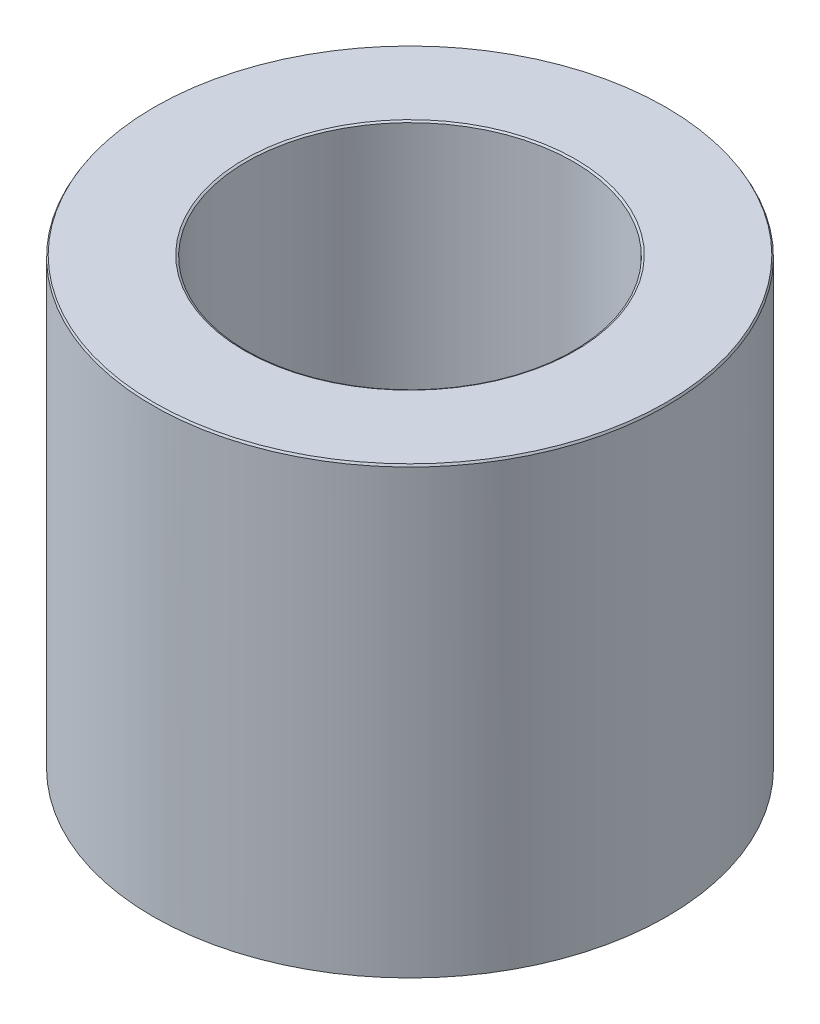
ISO-10303-21;
HEADER;
FILE_DESCRIPTION(('STEP AP214'),'2;1');
FILE_NAME('part.step','',(''),(''),'','','');
FILE_SCHEMA(('AUTOMOTIVE_DESIGN { 1 0 10303 214 1 1 1 1 }'));
ENDSEC;
DATA;
#1=APPLICATION_CONTEXT('core data for automotive mechanical design processes');
#2=APPLICATION_PROTOCOL_DEFINITION('international standard','automotive_design',2000,#1);
#3=PRODUCT_CONTEXT('',#1,'mechanical');
#4=PRODUCT('Part','Part','',(#3));
#5=PRODUCT_RELATED_PRODUCT_CATEGORY('part','',(#4));
#6=PRODUCT_DEFINITION_FORMATION('','',#4);
#7=PRODUCT_DEFINITION_CONTEXT('part definition',#1,'design');
#8=PRODUCT_DEFINITION('design','',#6,#7);
#9=PRODUCT_DEFINITION_SHAPE('','',#8);
#10=(LENGTH_UNIT() NAMED_UNIT(*) SI_UNIT(.MILLI.,.METRE.));
#11=(NAMED_UNIT(*) PLANE_ANGLE_UNIT() SI_UNIT($,.RADIAN.));
#12=(NAMED_UNIT(*) SI_UNIT($,.STERADIAN.) SOLID_ANGLE_UNIT());
#13=UNCERTAINTY_MEASURE_WITH_UNIT(LENGTH_MEASURE(1.E-05),#10,'distance_accuracy_value','');
#14=(GEOMETRIC_REPRESENTATION_CONTEXT(3) GLOBAL_UNCERTAINTY_ASSIGNED_CONTEXT((#13)) GLOBAL_UNIT_ASSIGNED_CONTEXT((#10,
#11,#12)) REPRESENTATION_CONTEXT('',''));
#15=CARTESIAN_POINT('',(0.,0.,0.));
#16=DIRECTION('',(0.,0.,1.));
#17=DIRECTION('',(1.,0.,0.));
#18=AXIS2_PLACEMENT_3D('',#15,#16,#17);
#19=CARTESIAN_POINT('',(0.,78.0220294571527,0.));
#20=DIRECTION('',(0.,-1.,0.));
#21=DIRECTION('',(0.,0.,-1.));
#22=AXIS2_PLACEMENT_3D('',#19,#20,#21);
#23=CYLINDRICAL_SURFACE('',#22,45.);
#24=CARTESIAN_POINT('',(0.,0.203917900582135,0.));
#25=DIRECTION('',(0.,1.,0.));
#26=DIRECTION('',(0.,0.,1.));
#27=AXIS2_PLACEMENT_3D('',#24,#25,#26);
#28=CIRCLE('',#27,45.);
#29=CARTESIAN_POINT('',(0.,0.203917900582121,-45.));
#30=VERTEX_POINT('',#29);
#31=EDGE_CURVE('E10',#30,#30,#28,.T.);
#32=CARTESIAN_POINT('',(0.,77.6688332927719,0.));
#33=DIRECTION('',(0.,1.,0.));
#34=DIRECTION('',(0.,0.,1.));
#35=AXIS2_PLACEMENT_3D('',#32,#33,#34);
#36=CIRCLE('',#35,45.);
#37=CARTESIAN_POINT('',(0.,77.6688332927719,-45.));
#38=VERTEX_POINT('',#37);
#39=EDGE_CURVE('E50',#38,#38,#36,.F.);
#40=CARTESIAN_POINT('',(0.,0.203917900582121,-45.));
#41=CARTESIAN_POINT('',(0.,1.0108441025841,-45.));
#42=CARTESIAN_POINT('',(0.,1.81777030458607,-45.));
#43=CARTESIAN_POINT('',(0.,3.43162270859002,-45.));
#44=CARTESIAN_POINT('',(0.,4.238548910592,-45.));
#45=CARTESIAN_POINT('',(0.,5.85240131459596,-45.));
#46=CARTESIAN_POINT('',(0.,6.65932751659793,-45.));
#47=CARTESIAN_POINT('',(0.,8.27317992060189,-45.));
#48=CARTESIAN_POINT('',(0.,9.08010612260387,-45.));
#49=CARTESIAN_POINT('',(0.,10.6939585266078,-45.));
#50=CARTESIAN_POINT('',(0.,11.5008847286098,-45.));
#51=CARTESIAN_POINT('',(0.,13.1147371326137,-45.));
#52=CARTESIAN_POINT('',(0.,13.9216633346157,-45.));
#53=CARTESIAN_POINT('',(0.,15.5355157386197,-45.));
#54=CARTESIAN_POINT('',(0.,16.3424419406217,-45.));
#55=CARTESIAN_POINT('',(0.,17.9562943446256,-45.));
#56=CARTESIAN_POINT('',(0.,18.7632205466276,-45.));
#57=CARTESIAN_POINT('',(0.,20.3770729506315,-45.));
#58=CARTESIAN_POINT('',(0.,21.1839991526335,-45.));
#59=CARTESIAN_POINT('',(0.,22.7978515566375,-45.));
#60=CARTESIAN_POINT('',(0.,23.6047777586394,-45.));
#61=CARTESIAN_POINT('',(0.,25.2186301626434,-45.));
#62=CARTESIAN_POINT('',(0.,26.0255563646454,-45.));
#63=CARTESIAN_POINT('',(0.,27.6394087686493,-45.));
#64=CARTESIAN_POINT('',(0.,28.4463349706513,-45.));
#65=CARTESIAN_POINT('',(0.,30.0601873746553,-45.));
#66=CARTESIAN_POINT('',(0.,30.8671135766572,-45.));
#67=CARTESIAN_POINT('',(0.,32.4809659806612,-45.));
#68=CARTESIAN_POINT('',(0.,33.2878921826632,-45.));
#69=CARTESIAN_POINT('',(0.,34.9017445866671,-45.));
#70=CARTESIAN_POINT('',(0.,35.7086707886691,-45.));
#71=CARTESIAN_POINT('',(0.,37.322523192673,-45.));
#72=CARTESIAN_POINT('',(0.,38.129449394675,-45.));
#73=CARTESIAN_POINT('',(0.,39.743301798679,-45.));
#74=CARTESIAN_POINT('',(0.,40.5502280006809,-45.));
#75=CARTESIAN_POINT('',(0.,42.1640804046849,-45.));
#76=CARTESIAN_POINT('',(0.,42.9710066066869,-45.));
#77=CARTESIAN_POINT('',(0.,44.5848590106908,-45.));
#78=CARTESIAN_POINT('',(0.,45.3917852126928,-45.));
#79=CARTESIAN_POINT('',(0.,47.0056376166968,-45.));
#80=CARTESIAN_POINT('',(0.,47.8125638186987,-45.));
#81=CARTESIAN_POINT('',(0.,49.4264162227027,-45.));
#82=CARTESIAN_POINT('',(0.,50.2333424247047,-45.));
#83=CARTESIAN_POINT('',(0.,51.8471948287086,-45.));
#84=CARTESIAN_POINT('',(0.,52.6541210307106,-45.));
#85=CARTESIAN_POINT('',(0.,54.2679734347145,-45.));
#86=CARTESIAN_POINT('',(0.,55.0748996367165,-45.));
#87=CARTESIAN_POINT('',(0.,56.6887520407205,-45.));
#88=CARTESIAN_POINT('',(0.,57.4956782427225,-45.));
#89=CARTESIAN_POINT('',(0.,59.1095306467264,-45.));
#90=CARTESIAN_POINT('',(0.,59.9164568487284,-45.));
#91=CARTESIAN_POINT('',(0.,61.5303092527323,-45.));
#92=CARTESIAN_POINT('',(0.,62.3372354547343,-45.));
#93=CARTESIAN_POINT('',(0.,63.9510878587383,-45.));
#94=CARTESIAN_POINT('',(0.,64.7580140607403,-45.));
#95=CARTESIAN_POINT('',(0.,66.3718664647442,-45.));
#96=CARTESIAN_POINT('',(0.,67.1787926667462,-45.));
#97=CARTESIAN_POINT('',(0.,68.7926450707501,-45.));
#98=CARTESIAN_POINT('',(0.,69.5995712727521,-45.));
#99=CARTESIAN_POINT('',(0.,71.2134236767561,-45.));
#100=CARTESIAN_POINT('',(0.,72.020349878758,-45.));
#101=CARTESIAN_POINT('',(0.,73.634202282762,-45.));
#102=CARTESIAN_POINT('',(0.,74.441128484764,-45.));
#103=CARTESIAN_POINT('',(0.,76.0549808887679,-45.));
#104=CARTESIAN_POINT('',(0.,76.8619070907699,-45.));
#105=CARTESIAN_POINT('',(0.,77.6688332927719,-45.));
#106=B_SPLINE_CURVE_WITH_KNOTS('',3,(#40,#41,#42,#43,#44,#45,#46,#47,#48,#49,#50,#51,#52,#53,
#54,#55,#56,#57,#58,#59,#60,#61,#62,#63,#64,#65,#66,#67,#68,#69,#70,#71,#72,#73,#74,#75,#76,#77,
#78,#79,#80,#81,#82,#83,#84,#85,#86,#87,#88,#89,#90,#91,#92,#93,#94,#95,#96,#97,#98,#99,#100,
#101,#102,#103,#104,#105),.UNSPECIFIED.,.F.,.F.,(4,2,2,2,2,2,2,2,2,2,2,2,2,2,2,2,2,2,2,2,2,2,2,
2,2,2,2,2,2,2,2,2,4),(0.,2.42077860600592,4.84155721201186,7.26233581801779,9.68311442402373,
12.1038930300296,14.5246716360356,16.9454502420415,19.3662288480474,21.7870074540534,
24.2077860600593,26.6285646660652,29.0493432720712,31.4701218780771,33.890900484083,
36.3116790900889,38.7324576960949,41.1532363021008,43.5740149081067,45.9947935141127,
48.4155721201186,50.8363507261245,53.2571293321304,55.6779079381364,58.0986865441423,
60.5194651501482,62.9402437561542,65.3610223621601,67.781800968166,70.202579574172,
72.6233581801779,75.0441367861838,77.4649153921898),.UNSPECIFIED.);
#107=EDGE_CURVE('BSEAM39',#30,#38,#106,.T.);
#108=ORIENTED_EDGE('',*,*,#31,.T.);
#109=ORIENTED_EDGE('',*,*,#39,.T.);
#110=ORIENTED_EDGE('',*,*,#107,.T.);
#111=ORIENTED_EDGE('',*,*,#107,.F.);
#112=EDGE_LOOP('',(#108,#110,#109,#111));
#113=FACE_BOUND('',#112,.T.);
#114=ADVANCED_FACE('F39',(#113),#23,.T.);
#115=CARTESIAN_POINT('',(0.,78.0220294571527,0.));
#116=DIRECTION('',(0.,1.,0.));
#117=DIRECTION('',(0.,0.,1.));
#118=AXIS2_PLACEMENT_3D('',#115,#116,#117);
#119=PLANE('',#118);
#120=CARTESIAN_POINT('',(0.,78.0220294571527,0.));
#121=DIRECTION('',(0.,1.,0.));
#122=DIRECTION('',(0.,0.,1.));
#123=AXIS2_PLACEMENT_3D('',#120,#121,#122);
#124=CIRCLE('',#123,29.0064003459728);
#125=CARTESIAN_POINT('',(0.,78.0220294571527,29.0064003459728));
#126=VERTEX_POINT('',#125);
#127=EDGE_CURVE('E58',#126,#126,#124,.F.);
#128=ORIENTED_EDGE('',*,*,#127,.T.);
#129=EDGE_LOOP('',(#128));
#130=FACE_BOUND('',#129,.T.);
#131=CARTESIAN_POINT('',(0.,78.0220294571527,0.));
#132=DIRECTION('',(0.,1.,0.));
#133=DIRECTION('',(0.,0.,1.));
#134=AXIS2_PLACEMENT_3D('',#131,#132,#133);
#135=CIRCLE('',#134,44.796082099418);
#136=CARTESIAN_POINT('',(0.,78.0220294571527,44.796082099418));
#137=VERTEX_POINT('',#136);
#138=EDGE_CURVE('E61',#137,#137,#135,.T.);
#139=ORIENTED_EDGE('',*,*,#138,.T.);
#140=EDGE_LOOP('',(#139));
#141=FACE_BOUND('',#140,.T.);
#142=ADVANCED_FACE('F88',(#130,#141),#119,.T.);
#143=CARTESIAN_POINT('',(0.,0.,0.));
#144=DIRECTION('',(0.,1.,0.));
#145=DIRECTION('',(0.,0.,1.));
#146=AXIS2_PLACEMENT_3D('',#143,#144,#145);
#147=PLANE('',#146);
#148=CARTESIAN_POINT('',(0.,0.,0.));
#149=DIRECTION('',(0.,1.,0.));
#150=DIRECTION('',(0.,0.,1.));
#151=AXIS2_PLACEMENT_3D('',#148,#149,#150);
#152=CIRCLE('',#151,28.8571220821739);
#153=CARTESIAN_POINT('',(0.,0.,28.8571220821739));
#154=VERTEX_POINT('',#153);
#155=EDGE_CURVE('E51',#154,#154,#152,.T.);
#156=ORIENTED_EDGE('',*,*,#155,.T.);
#157=EDGE_LOOP('',(#156));
#158=FACE_BOUND('',#157,.T.);
#159=CARTESIAN_POINT('',(0.,0.,0.));
#160=DIRECTION('',(0.,1.,0.));
#161=DIRECTION('',(0.,0.,1.));
#162=AXIS2_PLACEMENT_3D('',#159,#160,#161);
#163=CIRCLE('',#162,44.646803835619);
#164=CARTESIAN_POINT('',(0.,0.,44.646803835619));
#165=VERTEX_POINT('',#164);
#166=EDGE_CURVE('E54',#165,#165,#163,.F.);
#167=ORIENTED_EDGE('',*,*,#166,.T.);
#168=EDGE_LOOP('',(#167));
#169=FACE_BOUND('',#168,.T.);
#170=ADVANCED_FACE('F83',(#158,#169),#147,.F.);
#171=CARTESIAN_POINT('',(0.,78.0220294571527,0.));
#172=DIRECTION('',(0.,-1.,0.));
#173=DIRECTION('',(0.,0.,-1.));
#174=AXIS2_PLACEMENT_3D('',#171,#172,#173);
#175=CYLINDRICAL_SURFACE('',#174,28.6532041815918);
#176=CARTESIAN_POINT('',(0.,77.8181115565705,0.));
#177=DIRECTION('',(0.,1.,0.));
#178=DIRECTION('',(0.,0.,1.));
#179=AXIS2_PLACEMENT_3D('',#176,#177,#178);
#180=CIRCLE('',#179,28.6532041815918);
#181=CARTESIAN_POINT('',(0.,77.8181115565705,-28.6532041815918));
#182=VERTEX_POINT('',#181);
#183=EDGE_CURVE('E67',#182,#182,#180,.T.);
#184=CARTESIAN_POINT('',(0.,0.353196164380981,0.));
#185=DIRECTION('',(0.,1.,0.));
#186=DIRECTION('',(0.,0.,1.));
#187=AXIS2_PLACEMENT_3D('',#184,#185,#186);
#188=CIRCLE('',#187,28.6532041815918);
#189=CARTESIAN_POINT('',(0.,0.353196164380967,-28.6532041815918));
#190=VERTEX_POINT('',#189);
#191=EDGE_CURVE('E69',#190,#190,#188,.F.);
#192=CARTESIAN_POINT('',(0.,77.8181115565705,-28.6532041815918));
#193=CARTESIAN_POINT('',(0.,77.0111853545686,-28.6532041815918));
#194=CARTESIAN_POINT('',(0.,76.2042591525666,-28.6532041815918));
#195=CARTESIAN_POINT('',(0.,74.5904067485626,-28.6532041815918));
#196=CARTESIAN_POINT('',(0.,73.7834805465607,-28.6532041815918));
#197=CARTESIAN_POINT('',(0.,72.1696281425567,-28.6532041815918));
#198=CARTESIAN_POINT('',(0.,71.3627019405547,-28.6532041815918));
#199=CARTESIAN_POINT('',(0.,69.7488495365508,-28.6532041815918));
#200=CARTESIAN_POINT('',(0.,68.9419233345488,-28.6532041815918));
#201=CARTESIAN_POINT('',(0.,67.3280709305449,-28.6532041815918));
#202=CARTESIAN_POINT('',(0.,66.5211447285429,-28.6532041815918));
#203=CARTESIAN_POINT('',(0.,64.9072923245389,-28.6532041815918));
#204=CARTESIAN_POINT('',(0.,64.100366122537,-28.6532041815918));
#205=CARTESIAN_POINT('',(0.,62.486513718533,-28.6532041815918));
#206=CARTESIAN_POINT('',(0.,61.679587516531,-28.6532041815918));
#207=CARTESIAN_POINT('',(0.,60.0657351125271,-28.6532041815918));
#208=CARTESIAN_POINT('',(0.,59.2588089105251,-28.6532041815918));
#209=CARTESIAN_POINT('',(0.,57.6449565065212,-28.6532041815918));
#210=CARTESIAN_POINT('',(0.,56.8380303045192,-28.6532041815918));
#211=CARTESIAN_POINT('',(0.,55.2241779005152,-28.6532041815918));
#212=CARTESIAN_POINT('',(0.,54.4172516985133,-28.6532041815918));
#213=CARTESIAN_POINT('',(0.,52.8033992945093,-28.6532041815918));
#214=CARTESIAN_POINT('',(0.,51.9964730925073,-28.6532041815918));
#215=CARTESIAN_POINT('',(0.,50.3826206885034,-28.6532041815918));
#216=CARTESIAN_POINT('',(0.,49.5756944865014,-28.6532041815918));
#217=CARTESIAN_POINT('',(0.,47.9618420824975,-28.6532041815918));
#218=CARTESIAN_POINT('',(0.,47.1549158804955,-28.6532041815918));
#219=CARTESIAN_POINT('',(0.,45.5410634764915,-28.6532041815918));
#220=CARTESIAN_POINT('',(0.,44.7341372744896,-28.6532041815918));
#221=CARTESIAN_POINT('',(0.,43.1202848704856,-28.6532041815918));
#222=CARTESIAN_POINT('',(0.,42.3133586684837,-28.6532041815918));
#223=CARTESIAN_POINT('',(0.,40.6995062644797,-28.6532041815918));
#224=CARTESIAN_POINT('',(0.,39.8925800624777,-28.6532041815918));
#225=CARTESIAN_POINT('',(0.,38.2787276584738,-28.6532041815918));
#226=CARTESIAN_POINT('',(0.,37.4718014564718,-28.6532041815918));
#227=CARTESIAN_POINT('',(0.,35.8579490524679,-28.6532041815918));
#228=CARTESIAN_POINT('',(0.,35.0510228504659,-28.6532041815918));
#229=CARTESIAN_POINT('',(0.,33.4371704464619,-28.6532041815918));
#230=CARTESIAN_POINT('',(0.,32.63024424446,-28.6532041815918));
#231=CARTESIAN_POINT('',(0.,31.016391840456,-28.6532041815918));
#232=CARTESIAN_POINT('',(0.,30.209465638454,-28.6532041815918));
#233=CARTESIAN_POINT('',(0.,28.5956132344501,-28.6532041815918));
#234=CARTESIAN_POINT('',(0.,27.7886870324481,-28.6532041815918));
#235=CARTESIAN_POINT('',(0.,26.1748346284442,-28.6532041815918));
#236=CARTESIAN_POINT('',(0.,25.3679084264422,-28.6532041815918));
#237=CARTESIAN_POINT('',(0.,23.7540560224382,-28.6532041815918));
#238=CARTESIAN_POINT('',(0.,22.9471298204363,-28.6532041815918));
#239=CARTESIAN_POINT('',(0.,21.3332774164323,-28.6532041815918));
#240=CARTESIAN_POINT('',(0.,20.5263512144303,-28.6532041815918));
#241=CARTESIAN_POINT('',(0.,18.9124988104264,-28.6532041815918));
#242=CARTESIAN_POINT('',(0.,18.1055726084244,-28.6532041815918));
#243=CARTESIAN_POINT('',(0.,16.4917202044205,-28.6532041815918));
#244=CARTESIAN_POINT('',(0.,15.6847940024185,-28.6532041815918));
#245=CARTESIAN_POINT('',(0.,14.0709415984145,-28.6532041815918));
#246=CARTESIAN_POINT('',(0.,13.2640153964126,-28.6532041815918));
#247=CARTESIAN_POINT('',(0.,11.6501629924086,-28.6532041815918));
#248=CARTESIAN_POINT('',(0.,10.8432367904066,-28.6532041815918));
#249=CARTESIAN_POINT('',(0.,9.22938438640269,-28.6532041815918));
#250=CARTESIAN_POINT('',(0.,8.42245818440072,-28.6532041815918));
#251=CARTESIAN_POINT('',(0.,6.80860578039677,-28.6532041815918));
#252=CARTESIAN_POINT('',(0.,6.00167957839479,-28.6532041815918));
#253=CARTESIAN_POINT('',(0.,4.38782717439084,-28.6532041815918));
#254=CARTESIAN_POINT('',(0.,3.58090097238887,-28.6532041815918));
#255=CARTESIAN_POINT('',(0.,1.96704856838492,-28.6532041815918));
#256=CARTESIAN_POINT('',(0.,1.16012236638294,-28.6532041815918));
#257=CARTESIAN_POINT('',(0.,0.353196164380967,-28.6532041815918));
#258=B_SPLINE_CURVE_WITH_KNOTS('',3,(#192,#193,#194,#195,#196,#197,#198,#199,#200,#201,#202,
#203,#204,#205,#206,#207,#208,#209,#210,#211,#212,#213,#214,#215,#216,#217,#218,#219,#220,#221,
#222,#223,#224,#225,#226,#227,#228,#229,#230,#231,#232,#233,#234,#235,#236,#237,#238,#239,#240,
#241,#242,#243,#244,#245,#246,#247,#248,#249,#250,#251,#252,#253,#254,#255,#256,#257),
.UNSPECIFIED.,.F.,.F.,(4,2,2,2,2,2,2,2,2,2,2,2,2,2,2,2,2,2,2,2,2,2,2,2,2,2,2,2,2,2,2,2,4),(0.,
2.42077860600591,4.84155721201183,7.26233581801776,9.68311442402368,12.1038930300296,
14.5246716360355,16.9454502420415,19.3662288480474,21.7870074540533,24.2077860600592,
26.6285646660652,29.0493432720711,31.470121878077,33.8909004840829,36.3116790900888,
38.7324576960948,41.1532363021007,43.5740149081066,45.9947935141125,48.4155721201185,
50.8363507261244,53.2571293321303,55.6779079381362,58.0986865441422,60.5194651501481,
62.940243756154,65.3610223621599,67.7818009681659,70.2025795741718,72.6233581801777,
75.0441367861836,77.4649153921896),.UNSPECIFIED.);
#259=EDGE_CURVE('BSEAM71',#182,#190,#258,.T.);
#260=ORIENTED_EDGE('',*,*,#183,.T.);
#261=ORIENTED_EDGE('',*,*,#191,.T.);
#262=ORIENTED_EDGE('',*,*,#259,.T.);
#263=ORIENTED_EDGE('',*,*,#259,.F.);
#264=EDGE_LOOP('',(#260,#262,#261,#263));
#265=FACE_BOUND('',#264,.T.);
#266=ADVANCED_FACE('F71',(#265),#175,.F.);
#267=CARTESIAN_POINT('',(0.,77.8181115565705,0.));
#268=DIRECTION('',(0.,1.,0.));
#269=DIRECTION('',(0.,0.,1.));
#270=AXIS2_PLACEMENT_3D('',#267,#268,#269);
#271=CONICAL_SURFACE('',#270,28.6532041815918,1.04719755119657);
#272=ORIENTED_EDGE('',*,*,#127,.F.);
#273=EDGE_LOOP('',(#272));
#274=FACE_BOUND('',#273,.T.);
#275=ORIENTED_EDGE('',*,*,#183,.F.);
#276=EDGE_LOOP('',(#275));
#277=FACE_BOUND('',#276,.T.);
#278=ADVANCED_FACE('F77',(#274,#277),#271,.F.);
#279=CARTESIAN_POINT('',(0.,0.,0.));
#280=DIRECTION('',(0.,-1.,0.));
#281=DIRECTION('',(0.,0.,-1.));
#282=AXIS2_PLACEMENT_3D('',#279,#280,#281);
#283=CONICAL_SURFACE('',#282,28.8571220821739,0.523598775598278);
#284=ORIENTED_EDGE('',*,*,#191,.F.);
#285=EDGE_LOOP('',(#284));
#286=FACE_BOUND('',#285,.T.);
#287=ORIENTED_EDGE('',*,*,#155,.F.);
#288=EDGE_LOOP('',(#287));
#289=FACE_BOUND('',#288,.T.);
#290=ADVANCED_FACE('F73',(#286,#289),#283,.F.);
#291=CARTESIAN_POINT('',(0.,0.203917900582121,0.));
#292=DIRECTION('',(0.,1.,0.));
#293=DIRECTION('',(0.,0.,1.));
#294=AXIS2_PLACEMENT_3D('',#291,#292,#293);
#295=CONICAL_SURFACE('',#294,45.,1.04719755119664);
#296=ORIENTED_EDGE('',*,*,#166,.F.);
#297=EDGE_LOOP('',(#296));
#298=FACE_BOUND('',#297,.T.);
#299=ORIENTED_EDGE('',*,*,#31,.F.);
#300=EDGE_LOOP('',(#299));
#301=FACE_BOUND('',#300,.T.);
#302=ADVANCED_FACE('F76',(#298,#301),#295,.T.);
#303=CARTESIAN_POINT('',(0.,78.0220294571527,0.));
#304=DIRECTION('',(0.,-1.,0.));
#305=DIRECTION('',(0.,0.,-1.));
#306=AXIS2_PLACEMENT_3D('',#303,#304,#305);
#307=CONICAL_SURFACE('',#306,44.796082099418,0.523598775598305);
#308=ORIENTED_EDGE('',*,*,#39,.F.);
#309=EDGE_LOOP('',(#308));
#310=FACE_BOUND('',#309,.T.);
#311=ORIENTED_EDGE('',*,*,#138,.F.);
#312=EDGE_LOOP('',(#311));
#313=FACE_BOUND('',#312,.T.);
#314=ADVANCED_FACE('F45',(#310,#313),#307,.T.);
#315=CLOSED_SHELL('',(#114,#142,#170,#266,#278,#290,#302,#314));
#316=MANIFOLD_SOLID_BREP('B2',#315);
#317=ADVANCED_BREP_SHAPE_REPRESENTATION('',(#18,#316),#14);
#318=SHAPE_DEFINITION_REPRESENTATION(#9,#317);
ENDSEC;
END-ISO-10303-21;
